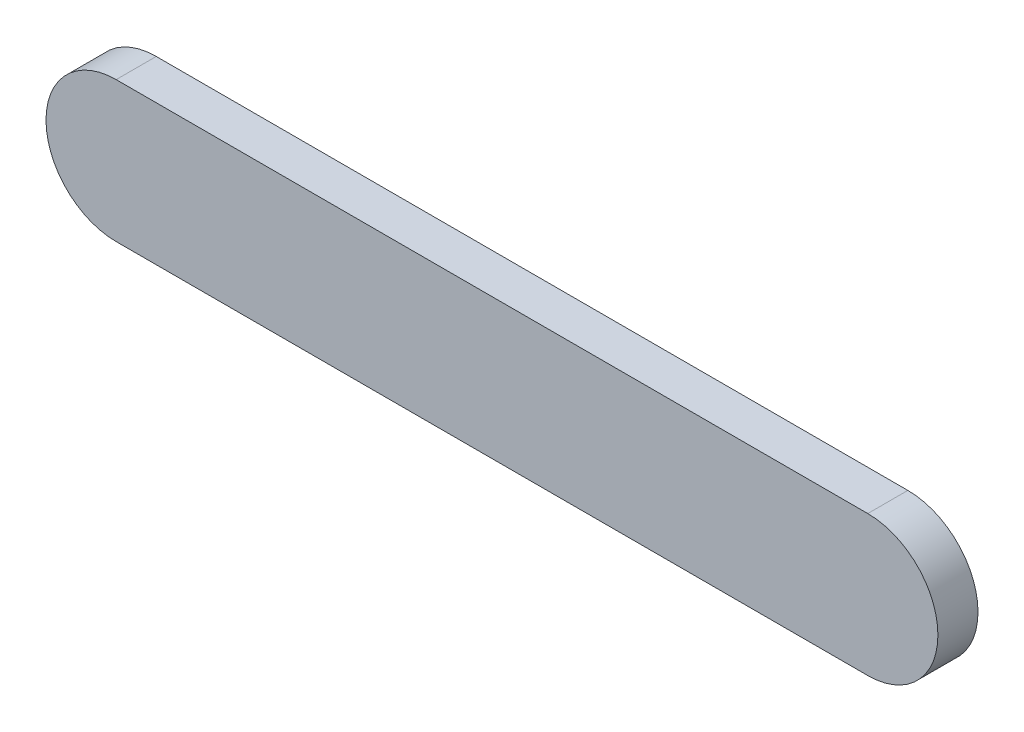
ISO-10303-21;
HEADER;
FILE_DESCRIPTION(('STEP AP214'),'2;1');
FILE_NAME('part.step','',(''),(''),'','','');
FILE_SCHEMA(('AUTOMOTIVE_DESIGN { 1 0 10303 214 1 1 1 1 }'));
ENDSEC;
DATA;
#1=APPLICATION_CONTEXT('core data for automotive mechanical design processes');
#2=APPLICATION_PROTOCOL_DEFINITION('international standard','automotive_design',2000,#1);
#3=PRODUCT_CONTEXT('',#1,'mechanical');
#4=PRODUCT('Part','Part','',(#3));
#5=PRODUCT_RELATED_PRODUCT_CATEGORY('part','',(#4));
#6=PRODUCT_DEFINITION_FORMATION('','',#4);
#7=PRODUCT_DEFINITION_CONTEXT('part definition',#1,'design');
#8=PRODUCT_DEFINITION('design','',#6,#7);
#9=PRODUCT_DEFINITION_SHAPE('','',#8);
#10=(LENGTH_UNIT() NAMED_UNIT(*) SI_UNIT(.MILLI.,.METRE.));
#11=(NAMED_UNIT(*) PLANE_ANGLE_UNIT() SI_UNIT($,.RADIAN.));
#12=(NAMED_UNIT(*) SI_UNIT($,.STERADIAN.) SOLID_ANGLE_UNIT());
#13=UNCERTAINTY_MEASURE_WITH_UNIT(LENGTH_MEASURE(1.E-05),#10,'distance_accuracy_value','');
#14=(GEOMETRIC_REPRESENTATION_CONTEXT(3) GLOBAL_UNCERTAINTY_ASSIGNED_CONTEXT((#13)) GLOBAL_UNIT_ASSIGNED_CONTEXT((#10,
#11,#12)) REPRESENTATION_CONTEXT('',''));
#15=CARTESIAN_POINT('',(0.,0.,0.));
#16=DIRECTION('',(0.,0.,1.));
#17=DIRECTION('',(1.,0.,0.));
#18=AXIS2_PLACEMENT_3D('',#15,#16,#17);
#19=CARTESIAN_POINT('',(-112.5,0.,12.));
#20=DIRECTION('',(0.,0.,-1.));
#21=DIRECTION('',(-1.,0.,0.));
#22=AXIS2_PLACEMENT_3D('',#19,#20,#21);
#23=CYLINDRICAL_SURFACE('',#22,21.);
#24=CARTESIAN_POINT('',(-112.5,0.,0.));
#25=DIRECTION('',(0.,0.,1.));
#26=DIRECTION('',(1.,0.,0.));
#27=AXIS2_PLACEMENT_3D('',#24,#25,#26);
#28=CIRCLE('',#27,21.);
#29=CARTESIAN_POINT('',(-112.5,21.,0.));
#30=VERTEX_POINT('',#29);
#31=CARTESIAN_POINT('',(-112.5,-21.,0.));
#32=VERTEX_POINT('',#31);
#33=EDGE_CURVE('E95',#30,#32,#28,.T.);
#34=ORIENTED_EDGE('',*,*,#33,.T.);
#35=DIRECTION('',(0.,0.,-1.));
#36=VECTOR('',#35,1.);
#37=CARTESIAN_POINT('',(-112.5,-21.,12.));
#38=LINE('',#37,#36);
#39=CARTESIAN_POINT('',(-112.5,-21.,12.));
#40=VERTEX_POINT('',#39);
#41=EDGE_CURVE('E11',#40,#32,#38,.T.);
#42=ORIENTED_EDGE('',*,*,#41,.F.);
#43=CARTESIAN_POINT('',(-112.5,0.,12.));
#44=DIRECTION('',(0.,0.,1.));
#45=DIRECTION('',(1.,0.,0.));
#46=AXIS2_PLACEMENT_3D('',#43,#44,#45);
#47=CIRCLE('',#46,21.);
#48=CARTESIAN_POINT('',(-112.5,21.,12.));
#49=VERTEX_POINT('',#48);
#50=EDGE_CURVE('E83',#49,#40,#47,.T.);
#51=ORIENTED_EDGE('',*,*,#50,.F.);
#52=DIRECTION('',(0.,0.,-1.));
#53=VECTOR('',#52,1.);
#54=CARTESIAN_POINT('',(-112.5,21.,12.));
#55=LINE('',#54,#53);
#56=EDGE_CURVE('E91',#49,#30,#55,.T.);
#57=ORIENTED_EDGE('',*,*,#56,.T.);
#58=EDGE_LOOP('',(#34,#42,#51,#57));
#59=FACE_BOUND('',#58,.T.);
#60=ADVANCED_FACE('F32',(#59),#23,.T.);
#61=CARTESIAN_POINT('',(-112.5,-21.,12.));
#62=DIRECTION('',(0.,1.,0.));
#63=DIRECTION('',(0.,0.,1.));
#64=AXIS2_PLACEMENT_3D('',#61,#62,#63);
#65=PLANE('',#64);
#66=DIRECTION('',(1.,0.,0.));
#67=VECTOR('',#66,1.);
#68=CARTESIAN_POINT('',(-112.5,-21.,0.));
#69=LINE('',#68,#67);
#70=CARTESIAN_POINT('',(112.5,-21.,0.));
#71=VERTEX_POINT('',#70);
#72=EDGE_CURVE('E87',#32,#71,#69,.T.);
#73=ORIENTED_EDGE('',*,*,#72,.T.);
#74=DIRECTION('',(0.,0.,-1.));
#75=VECTOR('',#74,1.);
#76=CARTESIAN_POINT('',(112.5,-21.,12.));
#77=LINE('',#76,#75);
#78=CARTESIAN_POINT('',(112.5,-21.,12.));
#79=VERTEX_POINT('',#78);
#80=EDGE_CURVE('E40',#79,#71,#77,.T.);
#81=ORIENTED_EDGE('',*,*,#80,.F.);
#82=DIRECTION('',(1.,0.,0.));
#83=VECTOR('',#82,1.);
#84=CARTESIAN_POINT('',(-112.5,-21.,12.));
#85=LINE('',#84,#83);
#86=EDGE_CURVE('E78',#40,#79,#85,.T.);
#87=ORIENTED_EDGE('',*,*,#86,.F.);
#88=ORIENTED_EDGE('',*,*,#41,.T.);
#89=EDGE_LOOP('',(#73,#81,#87,#88));
#90=FACE_BOUND('',#89,.T.);
#91=ADVANCED_FACE('F86',(#90),#65,.F.);
#92=CARTESIAN_POINT('',(112.5,0.,12.));
#93=DIRECTION('',(0.,0.,-1.));
#94=DIRECTION('',(-1.,0.,0.));
#95=AXIS2_PLACEMENT_3D('',#92,#93,#94);
#96=CYLINDRICAL_SURFACE('',#95,21.);
#97=CARTESIAN_POINT('',(112.5,0.,0.));
#98=DIRECTION('',(0.,0.,1.));
#99=DIRECTION('',(1.,0.,0.));
#100=AXIS2_PLACEMENT_3D('',#97,#98,#99);
#101=CIRCLE('',#100,21.);
#102=CARTESIAN_POINT('',(112.5,21.,0.));
#103=VERTEX_POINT('',#102);
#104=EDGE_CURVE('E65',#71,#103,#101,.T.);
#105=ORIENTED_EDGE('',*,*,#104,.T.);
#106=DIRECTION('',(0.,0.,-1.));
#107=VECTOR('',#106,1.);
#108=CARTESIAN_POINT('',(112.5,21.,12.));
#109=LINE('',#108,#107);
#110=CARTESIAN_POINT('',(112.5,21.,12.));
#111=VERTEX_POINT('',#110);
#112=EDGE_CURVE('E88',#111,#103,#109,.T.);
#113=ORIENTED_EDGE('',*,*,#112,.F.);
#114=CARTESIAN_POINT('',(112.5,0.,12.));
#115=DIRECTION('',(0.,0.,1.));
#116=DIRECTION('',(1.,0.,0.));
#117=AXIS2_PLACEMENT_3D('',#114,#115,#116);
#118=CIRCLE('',#117,21.);
#119=EDGE_CURVE('E81',#79,#111,#118,.T.);
#120=ORIENTED_EDGE('',*,*,#119,.F.);
#121=ORIENTED_EDGE('',*,*,#80,.T.);
#122=EDGE_LOOP('',(#105,#113,#120,#121));
#123=FACE_BOUND('',#122,.T.);
#124=ADVANCED_FACE('F89',(#123),#96,.T.);
#125=CARTESIAN_POINT('',(-112.5,21.,12.));
#126=DIRECTION('',(0.,-1.,0.));
#127=DIRECTION('',(0.,0.,-1.));
#128=AXIS2_PLACEMENT_3D('',#125,#126,#127);
#129=PLANE('',#128);
#130=DIRECTION('',(-1.,0.,0.));
#131=VECTOR('',#130,1.);
#132=CARTESIAN_POINT('',(-112.5,21.,0.));
#133=LINE('',#132,#131);
#134=EDGE_CURVE('E71',#103,#30,#133,.T.);
#135=ORIENTED_EDGE('',*,*,#134,.T.);
#136=ORIENTED_EDGE('',*,*,#56,.F.);
#137=DIRECTION('',(-1.,0.,0.));
#138=VECTOR('',#137,1.);
#139=CARTESIAN_POINT('',(-112.5,21.,12.));
#140=LINE('',#139,#138);
#141=EDGE_CURVE('E48',#111,#49,#140,.T.);
#142=ORIENTED_EDGE('',*,*,#141,.F.);
#143=ORIENTED_EDGE('',*,*,#112,.T.);
#144=EDGE_LOOP('',(#135,#136,#142,#143));
#145=FACE_BOUND('',#144,.T.);
#146=ADVANCED_FACE('F102',(#145),#129,.F.);
#147=CARTESIAN_POINT('',(-112.5,0.,12.));
#148=DIRECTION('',(0.,0.,1.));
#149=DIRECTION('',(1.,0.,0.));
#150=AXIS2_PLACEMENT_3D('',#147,#148,#149);
#151=PLANE('',#150);
#152=ORIENTED_EDGE('',*,*,#50,.T.);
#153=ORIENTED_EDGE('',*,*,#86,.T.);
#154=ORIENTED_EDGE('',*,*,#119,.T.);
#155=ORIENTED_EDGE('',*,*,#141,.T.);
#156=EDGE_LOOP('',(#152,#153,#154,#155));
#157=FACE_BOUND('',#156,.T.);
#158=ADVANCED_FACE('F79',(#157),#151,.T.);
#159=CARTESIAN_POINT('',(-112.5,0.,0.));
#160=DIRECTION('',(0.,0.,1.));
#161=DIRECTION('',(1.,0.,0.));
#162=AXIS2_PLACEMENT_3D('',#159,#160,#161);
#163=PLANE('',#162);
#164=ORIENTED_EDGE('',*,*,#33,.F.);
#165=ORIENTED_EDGE('',*,*,#134,.F.);
#166=ORIENTED_EDGE('',*,*,#104,.F.);
#167=ORIENTED_EDGE('',*,*,#72,.F.);
#168=EDGE_LOOP('',(#164,#165,#166,#167));
#169=FACE_BOUND('',#168,.T.);
#170=ADVANCED_FACE('F105',(#169),#163,.F.);
#171=CLOSED_SHELL('',(#60,#91,#124,#146,#158,#170));
#172=MANIFOLD_SOLID_BREP('B2',#171);
#173=ADVANCED_BREP_SHAPE_REPRESENTATION('',(#18,#172),#14);
#174=SHAPE_DEFINITION_REPRESENTATION(#9,#173);
ENDSEC;
END-ISO-10303-21;
